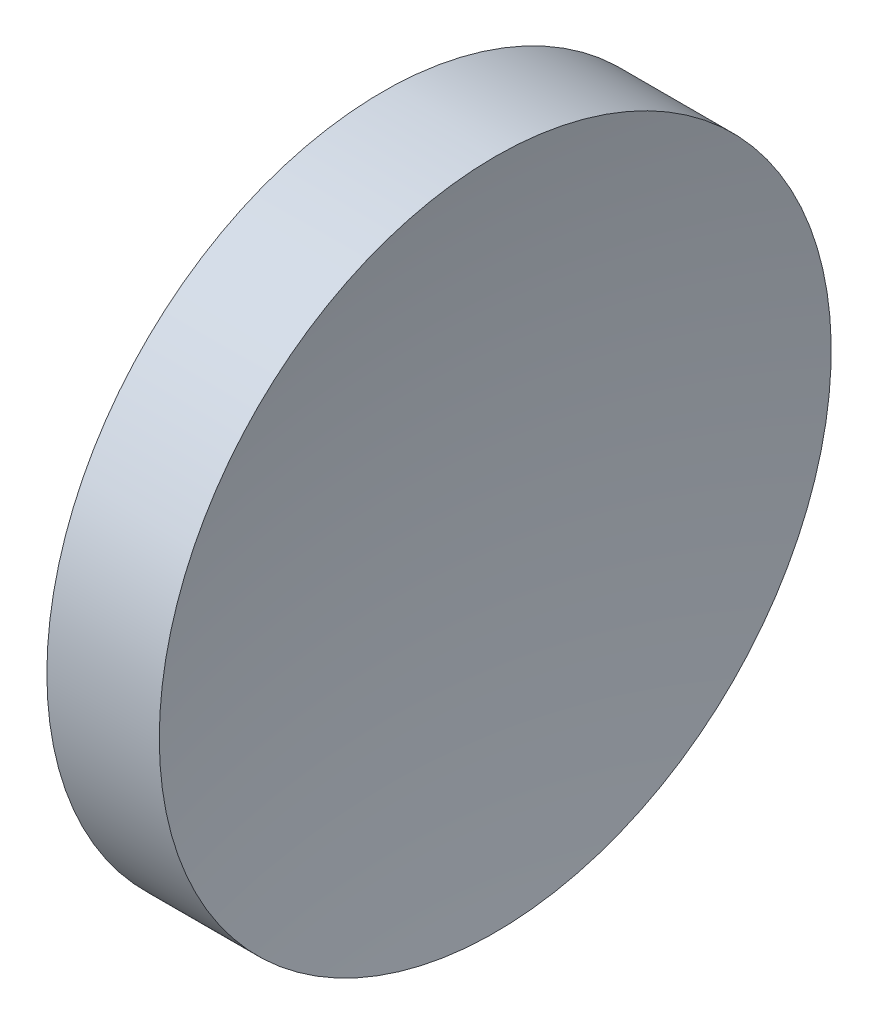
ISO-10303-21;
HEADER;
FILE_DESCRIPTION(('STEP AP214'),'2;1');
FILE_NAME('part.step','',(''),(''),'','','');
FILE_SCHEMA(('AUTOMOTIVE_DESIGN { 1 0 10303 214 1 1 1 1 }'));
ENDSEC;
DATA;
#1=APPLICATION_CONTEXT('core data for automotive mechanical design processes');
#2=APPLICATION_PROTOCOL_DEFINITION('international standard','automotive_design',2000,#1);
#3=PRODUCT_CONTEXT('',#1,'mechanical');
#4=PRODUCT('Part','Part','',(#3));
#5=PRODUCT_RELATED_PRODUCT_CATEGORY('part','',(#4));
#6=PRODUCT_DEFINITION_FORMATION('','',#4);
#7=PRODUCT_DEFINITION_CONTEXT('part definition',#1,'design');
#8=PRODUCT_DEFINITION('design','',#6,#7);
#9=PRODUCT_DEFINITION_SHAPE('','',#8);
#10=(LENGTH_UNIT() NAMED_UNIT(*) SI_UNIT(.MILLI.,.METRE.));
#11=(NAMED_UNIT(*) PLANE_ANGLE_UNIT() SI_UNIT($,.RADIAN.));
#12=(NAMED_UNIT(*) SI_UNIT($,.STERADIAN.) SOLID_ANGLE_UNIT());
#13=UNCERTAINTY_MEASURE_WITH_UNIT(LENGTH_MEASURE(1.E-05),#10,'distance_accuracy_value','');
#14=(GEOMETRIC_REPRESENTATION_CONTEXT(3) GLOBAL_UNCERTAINTY_ASSIGNED_CONTEXT((#13)) GLOBAL_UNIT_ASSIGNED_CONTEXT((#10,
#11,#12)) REPRESENTATION_CONTEXT('',''));
#15=CARTESIAN_POINT('',(0.,0.,0.));
#16=DIRECTION('',(0.,0.,1.));
#17=DIRECTION('',(1.,0.,0.));
#18=AXIS2_PLACEMENT_3D('',#15,#16,#17);
#19=CARTESIAN_POINT('',(439.199611931345,138.756042246745,0.));
#20=DIRECTION('',(-1.,0.,0.));
#21=DIRECTION('',(0.,1.,0.));
#22=AXIS2_PLACEMENT_3D('',#19,#20,#21);
#23=SPHERICAL_SURFACE('',#22,200.);
#24=CARTESIAN_POINT('',(242.746691362573,138.756042246745,0.));
#25=DIRECTION('',(-1.,0.,0.));
#26=DIRECTION('',(0.,0.,1.));
#27=AXIS2_PLACEMENT_3D('',#24,#25,#26);
#28=CIRCLE('',#27,37.5);
#29=CARTESIAN_POINT('',(242.746691362573,138.756042246745,37.5));
#30=VERTEX_POINT('',#29);
#31=EDGE_CURVE('E10',#30,#30,#28,.T.);
#32=ORIENTED_EDGE('',*,*,#31,.F.);
#33=EDGE_LOOP('',(#32));
#34=FACE_BOUND('',#33,.T.);
#35=ADVANCED_FACE('F35',(#34),#23,.F.);
#36=CARTESIAN_POINT('',(217.97028600433,138.756042246745,0.));
#37=DIRECTION('',(-1.,0.,0.));
#38=DIRECTION('',(0.,0.,1.));
#39=AXIS2_PLACEMENT_3D('',#36,#37,#38);
#40=CYLINDRICAL_SURFACE('',#39,37.5);
#41=CARTESIAN_POINT('',(230.199611905266,138.756042246745,0.));
#42=DIRECTION('',(-1.,0.,0.));
#43=DIRECTION('',(0.,0.,1.));
#44=AXIS2_PLACEMENT_3D('',#41,#42,#43);
#45=CIRCLE('',#44,37.5);
#46=CARTESIAN_POINT('',(230.199611905266,138.756042246745,37.5));
#47=VERTEX_POINT('',#46);
#48=EDGE_CURVE('E41',#47,#47,#45,.T.);
#49=ORIENTED_EDGE('',*,*,#48,.F.);
#50=EDGE_LOOP('',(#49));
#51=FACE_BOUND('',#50,.T.);
#52=ORIENTED_EDGE('',*,*,#31,.T.);
#53=EDGE_LOOP('',(#52));
#54=FACE_BOUND('',#53,.T.);
#55=ADVANCED_FACE('F49',(#51,#54),#40,.T.);
#56=CARTESIAN_POINT('',(230.199611905266,138.756042246745,0.));
#57=DIRECTION('',(1.,0.,0.));
#58=DIRECTION('',(0.,0.,-1.));
#59=AXIS2_PLACEMENT_3D('',#56,#57,#58);
#60=PLANE('',#59);
#61=ORIENTED_EDGE('',*,*,#48,.T.);
#62=EDGE_LOOP('',(#61));
#63=FACE_BOUND('',#62,.T.);
#64=ADVANCED_FACE('F47',(#63),#60,.F.);
#65=CLOSED_SHELL('',(#35,#55,#64));
#66=MANIFOLD_SOLID_BREP('B2',#65);
#67=ADVANCED_BREP_SHAPE_REPRESENTATION('',(#18,#66),#14);
#68=SHAPE_DEFINITION_REPRESENTATION(#9,#67);
ENDSEC;
END-ISO-10303-21;
